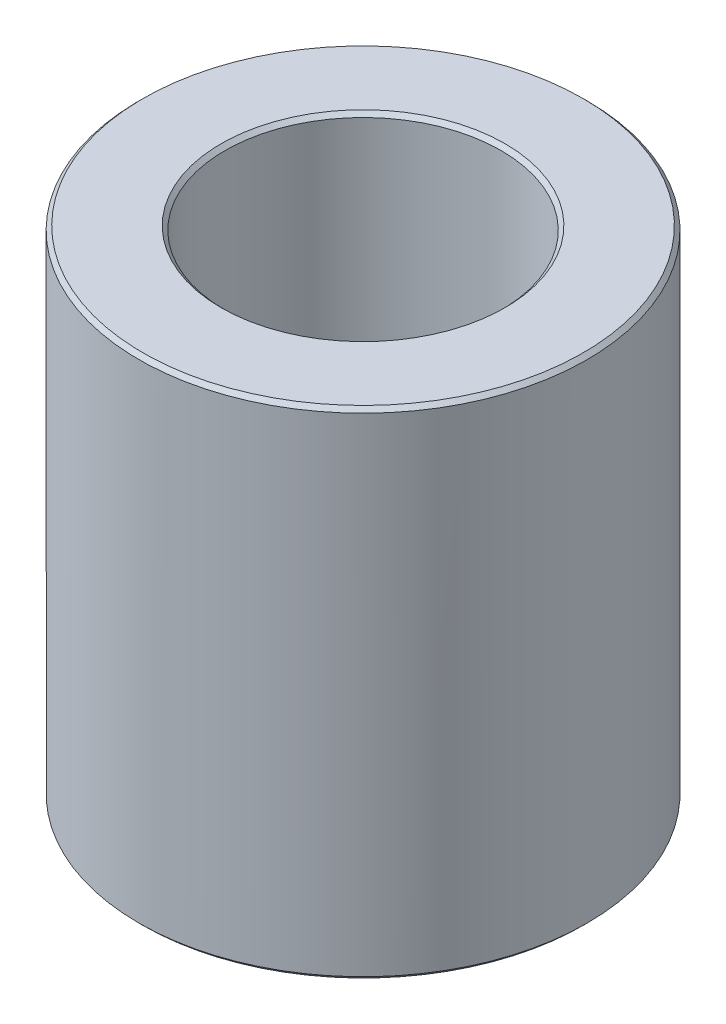
ISO-10303-21;
HEADER;
FILE_DESCRIPTION(('STEP AP214'),'2;1');
FILE_NAME('part.step','',(''),(''),'','','');
FILE_SCHEMA(('AUTOMOTIVE_DESIGN { 1 0 10303 214 1 1 1 1 }'));
ENDSEC;
DATA;
#1=APPLICATION_CONTEXT('core data for automotive mechanical design processes');
#2=APPLICATION_PROTOCOL_DEFINITION('international standard','automotive_design',2000,#1);
#3=PRODUCT_CONTEXT('',#1,'mechanical');
#4=PRODUCT('Part','Part','',(#3));
#5=PRODUCT_RELATED_PRODUCT_CATEGORY('part','',(#4));
#6=PRODUCT_DEFINITION_FORMATION('','',#4);
#7=PRODUCT_DEFINITION_CONTEXT('part definition',#1,'design');
#8=PRODUCT_DEFINITION('design','',#6,#7);
#9=PRODUCT_DEFINITION_SHAPE('','',#8);
#10=(LENGTH_UNIT() NAMED_UNIT(*) SI_UNIT(.MILLI.,.METRE.));
#11=(NAMED_UNIT(*) PLANE_ANGLE_UNIT() SI_UNIT($,.RADIAN.));
#12=(NAMED_UNIT(*) SI_UNIT($,.STERADIAN.) SOLID_ANGLE_UNIT());
#13=UNCERTAINTY_MEASURE_WITH_UNIT(LENGTH_MEASURE(1.E-05),#10,'distance_accuracy_value','');
#14=(GEOMETRIC_REPRESENTATION_CONTEXT(3) GLOBAL_UNCERTAINTY_ASSIGNED_CONTEXT((#13)) GLOBAL_UNIT_ASSIGNED_CONTEXT((#10,
#11,#12)) REPRESENTATION_CONTEXT('',''));
#15=CARTESIAN_POINT('',(0.,0.,0.));
#16=DIRECTION('',(0.,0.,1.));
#17=DIRECTION('',(1.,0.,0.));
#18=AXIS2_PLACEMENT_3D('',#15,#16,#17);
#19=CARTESIAN_POINT('',(0.,105.103769710325,0.));
#20=DIRECTION('',(0.,-1.,0.));
#21=DIRECTION('',(0.,0.,-1.));
#22=AXIS2_PLACEMENT_3D('',#19,#20,#21);
#23=CYLINDRICAL_SURFACE('',#22,47.5);
#24=CARTESIAN_POINT('',(0.,0.836841464975702,0.));
#25=DIRECTION('',(0.,1.,0.));
#26=DIRECTION('',(0.,0.,1.));
#27=AXIS2_PLACEMENT_3D('',#24,#25,#26);
#28=CIRCLE('',#27,47.5);
#29=CARTESIAN_POINT('',(0.,0.836841464975702,47.5));
#30=VERTEX_POINT('',#29);
#31=EDGE_CURVE('E10',#30,#30,#28,.T.);
#32=ORIENTED_EDGE('',*,*,#31,.T.);
#33=EDGE_LOOP('',(#32));
#34=FACE_BOUND('',#33,.T.);
#35=CARTESIAN_POINT('',(0.,104.266928245349,0.));
#36=DIRECTION('',(0.,1.,0.));
#37=DIRECTION('',(0.,0.,1.));
#38=AXIS2_PLACEMENT_3D('',#35,#36,#37);
#39=CIRCLE('',#38,47.5);
#40=CARTESIAN_POINT('',(0.,104.266928245349,-47.5));
#41=VERTEX_POINT('',#40);
#42=EDGE_CURVE('E50',#41,#41,#39,.F.);
#43=ORIENTED_EDGE('',*,*,#42,.T.);
#44=EDGE_LOOP('',(#43));
#45=FACE_BOUND('',#44,.T.);
#46=ADVANCED_FACE('F39',(#34,#45),#23,.T.);
#47=CARTESIAN_POINT('',(0.,105.103769710325,0.));
#48=DIRECTION('',(0.,1.,0.));
#49=DIRECTION('',(0.,0.,1.));
#50=AXIS2_PLACEMENT_3D('',#47,#48,#49);
#51=PLANE('',#50);
#52=CARTESIAN_POINT('',(0.,105.103769710325,0.));
#53=DIRECTION('',(0.,1.,0.));
#54=DIRECTION('',(0.,0.,1.));
#55=AXIS2_PLACEMENT_3D('',#52,#53,#54);
#56=CIRCLE('',#55,30.1029337472891);
#57=CARTESIAN_POINT('',(0.,105.103769710325,30.1029337472891));
#58=VERTEX_POINT('',#57);
#59=EDGE_CURVE('E58',#58,#58,#56,.F.);
#60=ORIENTED_EDGE('',*,*,#59,.T.);
#61=EDGE_LOOP('',(#60));
#62=FACE_BOUND('',#61,.T.);
#63=CARTESIAN_POINT('',(0.,105.103769710325,0.));
#64=DIRECTION('',(0.,1.,0.));
#65=DIRECTION('',(0.,0.,1.));
#66=AXIS2_PLACEMENT_3D('',#63,#64,#65);
#67=CIRCLE('',#66,46.6631585350243);
#68=CARTESIAN_POINT('',(0.,105.103769710325,-46.6631585350243));
#69=VERTEX_POINT('',#68);
#70=EDGE_CURVE('E61',#69,#69,#67,.T.);
#71=ORIENTED_EDGE('',*,*,#70,.T.);
#72=EDGE_LOOP('',(#71));
#73=FACE_BOUND('',#72,.T.);
#74=ADVANCED_FACE('F88',(#62,#73),#51,.T.);
#75=CARTESIAN_POINT('',(0.,0.,0.));
#76=DIRECTION('',(0.,1.,0.));
#77=DIRECTION('',(0.,0.,1.));
#78=AXIS2_PLACEMENT_3D('',#75,#76,#77);
#79=PLANE('',#78);
#80=CARTESIAN_POINT('',(0.,0.,0.));
#81=DIRECTION('',(0.,1.,0.));
#82=DIRECTION('',(0.,0.,1.));
#83=AXIS2_PLACEMENT_3D('',#80,#81,#82);
#84=CIRCLE('',#83,30.1029337472891);
#85=CARTESIAN_POINT('',(0.,0.,30.1029337472891));
#86=VERTEX_POINT('',#85);
#87=EDGE_CURVE('E51',#86,#86,#84,.T.);
#88=ORIENTED_EDGE('',*,*,#87,.T.);
#89=EDGE_LOOP('',(#88));
#90=FACE_BOUND('',#89,.T.);
#91=CARTESIAN_POINT('',(0.,0.,0.));
#92=DIRECTION('',(0.,1.,0.));
#93=DIRECTION('',(0.,0.,1.));
#94=AXIS2_PLACEMENT_3D('',#91,#92,#93);
#95=CIRCLE('',#94,46.6631585350243);
#96=CARTESIAN_POINT('',(0.,0.,46.6631585350243));
#97=VERTEX_POINT('',#96);
#98=EDGE_CURVE('E54',#97,#97,#95,.F.);
#99=ORIENTED_EDGE('',*,*,#98,.T.);
#100=EDGE_LOOP('',(#99));
#101=FACE_BOUND('',#100,.T.);
#102=ADVANCED_FACE('F83',(#90,#101),#79,.F.);
#103=CARTESIAN_POINT('',(0.,105.103769710325,0.));
#104=DIRECTION('',(0.,-1.,0.));
#105=DIRECTION('',(0.,0.,-1.));
#106=AXIS2_PLACEMENT_3D('',#103,#104,#105);
#107=CYLINDRICAL_SURFACE('',#106,29.2660922823134);
#108=CARTESIAN_POINT('',(0.,104.266928245349,0.));
#109=DIRECTION('',(0.,1.,0.));
#110=DIRECTION('',(0.,0.,1.));
#111=AXIS2_PLACEMENT_3D('',#108,#109,#110);
#112=CIRCLE('',#111,29.2660922823134);
#113=CARTESIAN_POINT('',(0.,104.266928245349,29.2660922823134));
#114=VERTEX_POINT('',#113);
#115=EDGE_CURVE('E67',#114,#114,#112,.T.);
#116=ORIENTED_EDGE('',*,*,#115,.T.);
#117=EDGE_LOOP('',(#116));
#118=FACE_BOUND('',#117,.T.);
#119=CARTESIAN_POINT('',(0.,0.836841464975716,0.));
#120=DIRECTION('',(0.,1.,0.));
#121=DIRECTION('',(0.,0.,1.));
#122=AXIS2_PLACEMENT_3D('',#119,#120,#121);
#123=CIRCLE('',#122,29.2660922823134);
#124=CARTESIAN_POINT('',(0.,0.836841464975716,29.2660922823134));
#125=VERTEX_POINT('',#124);
#126=EDGE_CURVE('E69',#125,#125,#123,.F.);
#127=ORIENTED_EDGE('',*,*,#126,.T.);
#128=EDGE_LOOP('',(#127));
#129=FACE_BOUND('',#128,.T.);
#130=ADVANCED_FACE('F71',(#118,#129),#107,.F.);
#131=CARTESIAN_POINT('',(0.,104.266928245349,0.));
#132=DIRECTION('',(0.,1.,0.));
#133=DIRECTION('',(0.,0.,1.));
#134=AXIS2_PLACEMENT_3D('',#131,#132,#133);
#135=CONICAL_SURFACE('',#134,29.2660922823134,0.785398163397444);
#136=ORIENTED_EDGE('',*,*,#59,.F.);
#137=EDGE_LOOP('',(#136));
#138=FACE_BOUND('',#137,.T.);
#139=ORIENTED_EDGE('',*,*,#115,.F.);
#140=EDGE_LOOP('',(#139));
#141=FACE_BOUND('',#140,.T.);
#142=ADVANCED_FACE('F77',(#138,#141),#135,.F.);
#143=CARTESIAN_POINT('',(0.,0.,0.));
#144=DIRECTION('',(0.,-1.,0.));
#145=DIRECTION('',(0.,0.,-1.));
#146=AXIS2_PLACEMENT_3D('',#143,#144,#145);
#147=CONICAL_SURFACE('',#146,30.1029337472891,0.785398163397444);
#148=ORIENTED_EDGE('',*,*,#126,.F.);
#149=EDGE_LOOP('',(#148));
#150=FACE_BOUND('',#149,.T.);
#151=ORIENTED_EDGE('',*,*,#87,.F.);
#152=EDGE_LOOP('',(#151));
#153=FACE_BOUND('',#152,.T.);
#154=ADVANCED_FACE('F73',(#150,#153),#147,.F.);
#155=CARTESIAN_POINT('',(0.,0.836841464975702,0.));
#156=DIRECTION('',(0.,1.,0.));
#157=DIRECTION('',(0.,0.,1.));
#158=AXIS2_PLACEMENT_3D('',#155,#156,#157);
#159=CONICAL_SURFACE('',#158,47.5,0.785398163397444);
#160=ORIENTED_EDGE('',*,*,#98,.F.);
#161=EDGE_LOOP('',(#160));
#162=FACE_BOUND('',#161,.T.);
#163=ORIENTED_EDGE('',*,*,#31,.F.);
#164=EDGE_LOOP('',(#163));
#165=FACE_BOUND('',#164,.T.);
#166=ADVANCED_FACE('F76',(#162,#165),#159,.T.);
#167=CARTESIAN_POINT('',(0.,105.103769710325,0.));
#168=DIRECTION('',(0.,-1.,0.));
#169=DIRECTION('',(0.,0.,-1.));
#170=AXIS2_PLACEMENT_3D('',#167,#168,#169);
#171=CONICAL_SURFACE('',#170,46.6631585350243,0.78539816339744);
#172=CARTESIAN_POINT('',(0.,104.266928245349,-47.5));
#173=CARTESIAN_POINT('',(0.,104.275645343943,-47.4912829014065));
#174=CARTESIAN_POINT('',(0.,104.284362442536,-47.482565802813));
#175=CARTESIAN_POINT('',(0.,104.301796639723,-47.465131605626));
#176=CARTESIAN_POINT('',(0.,104.310513738317,-47.4564145070325));
#177=CARTESIAN_POINT('',(0.,104.327947935504,-47.4389803098455));
#178=CARTESIAN_POINT('',(0.,104.336665034097,-47.430263211252));
#179=CARTESIAN_POINT('',(0.,104.354099231284,-47.4128290140651));
#180=CARTESIAN_POINT('',(0.,104.362816329878,-47.4041119154716));
#181=CARTESIAN_POINT('',(0.,104.380250527065,-47.3866777182846));
#182=CARTESIAN_POINT('',(0.,104.388967625658,-47.3779606196911));
#183=CARTESIAN_POINT('',(0.,104.406401822845,-47.3605264225041));
#184=CARTESIAN_POINT('',(0.,104.415118921439,-47.3518093239106));
#185=CARTESIAN_POINT('',(0.,104.432553118626,-47.3343751267236));
#186=CARTESIAN_POINT('',(0.,104.441270217219,-47.3256580281301));
#187=CARTESIAN_POINT('',(0.,104.458704414406,-47.3082238309431));
#188=CARTESIAN_POINT('',(0.,104.467421513,-47.2995067323496));
#189=CARTESIAN_POINT('',(0.,104.484855710187,-47.2820725351626));
#190=CARTESIAN_POINT('',(0.,104.49357280878,-47.2733554365691));
#191=CARTESIAN_POINT('',(0.,104.511007005967,-47.2559212393821));
#192=CARTESIAN_POINT('',(0.,104.519724104561,-47.2472041407886));
#193=CARTESIAN_POINT('',(0.,104.537158301748,-47.2297699436016));
#194=CARTESIAN_POINT('',(0.,104.545875400341,-47.2210528450081));
#195=CARTESIAN_POINT('',(0.,104.563309597528,-47.2036186478211));
#196=CARTESIAN_POINT('',(0.,104.572026696122,-47.1949015492276));
#197=CARTESIAN_POINT('',(0.,104.589460893309,-47.1774673520406));
#198=CARTESIAN_POINT('',(0.,104.598177991902,-47.1687502534471));
#199=CARTESIAN_POINT('',(0.,104.615612189089,-47.1513160562601));
#200=CARTESIAN_POINT('',(0.,104.624329287683,-47.1425989576666));
#201=CARTESIAN_POINT('',(0.,104.64176348487,-47.1251647604796));
#202=CARTESIAN_POINT('',(0.,104.650480583463,-47.1164476618861));
#203=CARTESIAN_POINT('',(0.,104.66791478065,-47.0990134646991));
#204=CARTESIAN_POINT('',(0.,104.676631879243,-47.0902963661056));
#205=CARTESIAN_POINT('',(0.,104.69406607643,-47.0728621689187));
#206=CARTESIAN_POINT('',(0.,104.702783175024,-47.0641450703252));
#207=CARTESIAN_POINT('',(0.,104.720217372211,-47.0467108731382));
#208=CARTESIAN_POINT('',(0.,104.728934470804,-47.0379937745447));
#209=CARTESIAN_POINT('',(0.,104.746368667991,-47.0205595773577));
#210=CARTESIAN_POINT('',(0.,104.755085766585,-47.0118424787642));
#211=CARTESIAN_POINT('',(0.,104.772519963772,-46.9944082815772));
#212=CARTESIAN_POINT('',(0.,104.781237062365,-46.9856911829837));
#213=CARTESIAN_POINT('',(0.,104.798671259552,-46.9682569857967));
#214=CARTESIAN_POINT('',(0.,104.807388358146,-46.9595398872032));
#215=CARTESIAN_POINT('',(0.,104.824822555333,-46.9421056900162));
#216=CARTESIAN_POINT('',(0.,104.833539653926,-46.9333885914227));
#217=CARTESIAN_POINT('',(0.,104.850973851113,-46.9159543942357));
#218=CARTESIAN_POINT('',(0.,104.859690949707,-46.9072372956422));
#219=CARTESIAN_POINT('',(0.,104.877125146894,-46.8898030984552));
#220=CARTESIAN_POINT('',(0.,104.885842245487,-46.8810859998617));
#221=CARTESIAN_POINT('',(0.,104.903276442674,-46.8636518026747));
#222=CARTESIAN_POINT('',(0.,104.911993541268,-46.8549347040812));
#223=CARTESIAN_POINT('',(0.,104.929427738455,-46.8375005068942));
#224=CARTESIAN_POINT('',(0.,104.938144837048,-46.8287834083007));
#225=CARTESIAN_POINT('',(0.,104.955579034235,-46.8113492111137));
#226=CARTESIAN_POINT('',(0.,104.964296132829,-46.8026321125203));
#227=CARTESIAN_POINT('',(0.,104.981730330016,-46.7851979153333));
#228=CARTESIAN_POINT('',(0.,104.990447428609,-46.7764808167398));
#229=CARTESIAN_POINT('',(0.,105.007881625796,-46.7590466195528));
#230=CARTESIAN_POINT('',(0.,105.01659872439,-46.7503295209593));
#231=CARTESIAN_POINT('',(0.,105.034032921577,-46.7328953237723));
#232=CARTESIAN_POINT('',(0.,105.04275002017,-46.7241782251788));
#233=CARTESIAN_POINT('',(0.,105.060184217357,-46.7067440279918));
#234=CARTESIAN_POINT('',(0.,105.068901315951,-46.6980269293983));
#235=CARTESIAN_POINT('',(0.,105.086335513138,-46.6805927322113));
#236=CARTESIAN_POINT('',(0.,105.095052611731,-46.6718756336178));
#237=CARTESIAN_POINT('',(0.,105.103769710325,-46.6631585350243));
#238=B_SPLINE_CURVE_WITH_KNOTS('',3,(#172,#173,#174,#175,#176,#177,#178,#179,#180,#181,#182,
#183,#184,#185,#186,#187,#188,#189,#190,#191,#192,#193,#194,#195,#196,#197,#198,#199,#200,#201,
#202,#203,#204,#205,#206,#207,#208,#209,#210,#211,#212,#213,#214,#215,#216,#217,#218,#219,#220,
#221,#222,#223,#224,#225,#226,#227,#228,#229,#230,#231,#232,#233,#234,#235,#236,#237),
.UNSPECIFIED.,.F.,.F.,(4,2,2,2,2,2,2,2,2,2,2,2,2,2,2,2,2,2,2,2,2,2,2,2,2,2,2,2,2,2,2,2,4),(0.,
0.0369835171664076,0.0739670343328053,0.110950551499208,0.147934068665606,0.184917585832013,
0.221901102998411,0.258884620164819,0.295868137331211,0.332851654497609,0.369835171664017,
0.406818688830414,0.443802205996822,0.48078572316322,0.517769240329622,0.55475275749602,
0.591736274662418,0.628719791828826,0.665703308995223,0.702686826161626,0.739670343328024,
0.776653860494431,0.813637377660829,0.850620894827237,0.88760441199363,0.924587929160027,
0.961571446326435,0.998554963492833,1.03553848065924,1.07252199782564,1.10950551499204,
1.14648903215844,1.18347254932485),.UNSPECIFIED.);
#239=EDGE_CURVE('BSEAM45',#41,#69,#238,.T.);
#240=ORIENTED_EDGE('',*,*,#42,.F.);
#241=ORIENTED_EDGE('',*,*,#70,.F.);
#242=ORIENTED_EDGE('',*,*,#239,.T.);
#243=ORIENTED_EDGE('',*,*,#239,.F.);
#244=EDGE_LOOP('',(#240,#242,#241,#243));
#245=FACE_BOUND('',#244,.T.);
#246=ADVANCED_FACE('F45',(#245),#171,.T.);
#247=CLOSED_SHELL('',(#46,#74,#102,#130,#142,#154,#166,#246));
#248=MANIFOLD_SOLID_BREP('B2',#247);
#249=ADVANCED_BREP_SHAPE_REPRESENTATION('',(#18,#248),#14);
#250=SHAPE_DEFINITION_REPRESENTATION(#9,#249);
ENDSEC;
END-ISO-10303-21;
